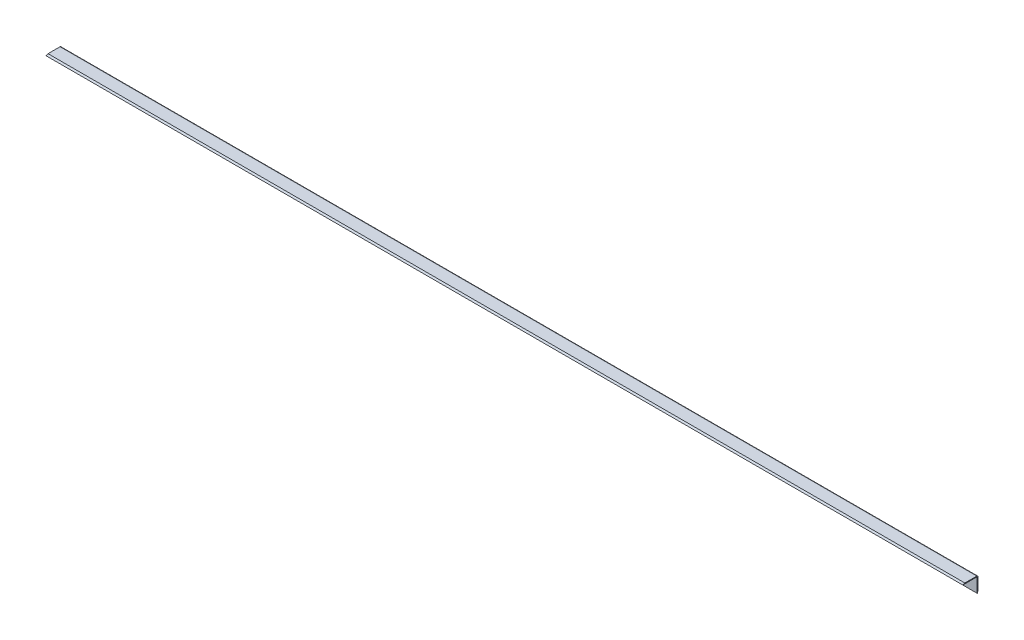
ISO-10303-21;
HEADER;
FILE_DESCRIPTION(('STEP AP214'),'2;1');
FILE_NAME('part.step','',(''),(''),'','','');
FILE_SCHEMA(('AUTOMOTIVE_DESIGN { 1 0 10303 214 1 1 1 1 }'));
ENDSEC;
DATA;
#1=APPLICATION_CONTEXT('core data for automotive mechanical design processes');
#2=APPLICATION_PROTOCOL_DEFINITION('international standard','automotive_design',2000,#1);
#3=PRODUCT_CONTEXT('',#1,'mechanical');
#4=PRODUCT('Part','Part','',(#3));
#5=PRODUCT_RELATED_PRODUCT_CATEGORY('part','',(#4));
#6=PRODUCT_DEFINITION_FORMATION('','',#4);
#7=PRODUCT_DEFINITION_CONTEXT('part definition',#1,'design');
#8=PRODUCT_DEFINITION('design','',#6,#7);
#9=PRODUCT_DEFINITION_SHAPE('','',#8);
#10=(LENGTH_UNIT() NAMED_UNIT(*) SI_UNIT(.MILLI.,.METRE.));
#11=(NAMED_UNIT(*) PLANE_ANGLE_UNIT() SI_UNIT($,.RADIAN.));
#12=(NAMED_UNIT(*) SI_UNIT($,.STERADIAN.) SOLID_ANGLE_UNIT());
#13=UNCERTAINTY_MEASURE_WITH_UNIT(LENGTH_MEASURE(1.E-05),#10,'distance_accuracy_value','');
#14=(GEOMETRIC_REPRESENTATION_CONTEXT(3) GLOBAL_UNCERTAINTY_ASSIGNED_CONTEXT((#13)) GLOBAL_UNIT_ASSIGNED_CONTEXT((#10,
#11,#12)) REPRESENTATION_CONTEXT('',''));
#15=CARTESIAN_POINT('',(0.,0.,0.));
#16=DIRECTION('',(0.,0.,1.));
#17=DIRECTION('',(1.,0.,0.));
#18=AXIS2_PLACEMENT_3D('',#15,#16,#17);
#19=CARTESIAN_POINT('',(904.875,-1.5,0.));
#20=DIRECTION('',(0.,1.,0.));
#21=DIRECTION('',(0.,0.,1.));
#22=AXIS2_PLACEMENT_3D('',#19,#20,#21);
#23=PLANE('',#22);
#24=DIRECTION('',(0.,0.,-1.));
#25=VECTOR('',#24,1.);
#26=CARTESIAN_POINT('',(-904.875,-1.5,0.));
#27=LINE('',#26,#25);
#28=CARTESIAN_POINT('',(-904.875,-1.5,0.));
#29=VERTEX_POINT('',#28);
#30=CARTESIAN_POINT('',(-904.875,-1.5,-28.5));
#31=VERTEX_POINT('',#30);
#32=EDGE_CURVE('E153',#29,#31,#27,.T.);
#33=ORIENTED_EDGE('',*,*,#32,.T.);
#34=DIRECTION('',(-1.,0.,0.));
#35=VECTOR('',#34,1.);
#36=CARTESIAN_POINT('',(904.875,-1.5,-28.5));
#37=LINE('',#36,#35);
#38=CARTESIAN_POINT('',(904.875,-1.5,-28.5));
#39=VERTEX_POINT('',#38);
#40=EDGE_CURVE('E117',#39,#31,#37,.T.);
#41=ORIENTED_EDGE('',*,*,#40,.F.);
#42=DIRECTION('',(0.,0.,-1.));
#43=VECTOR('',#42,1.);
#44=CARTESIAN_POINT('',(904.875,-1.5,0.));
#45=LINE('',#44,#43);
#46=CARTESIAN_POINT('',(904.875,-1.5,0.));
#47=VERTEX_POINT('',#46);
#48=EDGE_CURVE('E103',#47,#39,#45,.T.);
#49=ORIENTED_EDGE('',*,*,#48,.F.);
#50=DIRECTION('',(-1.,0.,0.));
#51=VECTOR('',#50,1.);
#52=CARTESIAN_POINT('',(904.875,-1.5,0.));
#53=LINE('',#52,#51);
#54=EDGE_CURVE('E115',#47,#29,#53,.T.);
#55=ORIENTED_EDGE('',*,*,#54,.T.);
#56=EDGE_LOOP('',(#33,#41,#49,#55));
#57=FACE_BOUND('',#56,.T.);
#58=ADVANCED_FACE('F43',(#57),#23,.F.);
#59=CARTESIAN_POINT('',(904.875,-1.5,-28.5));
#60=DIRECTION('',(0.,0.,-1.));
#61=DIRECTION('',(-1.,0.,0.));
#62=AXIS2_PLACEMENT_3D('',#59,#60,#61);
#63=PLANE('',#62);
#64=DIRECTION('',(0.,-1.,0.));
#65=VECTOR('',#64,1.);
#66=CARTESIAN_POINT('',(-904.875,-1.5,-28.5));
#67=LINE('',#66,#65);
#68=CARTESIAN_POINT('',(-904.875,-30.,-28.5));
#69=VERTEX_POINT('',#68);
#70=EDGE_CURVE('E148',#31,#69,#67,.T.);
#71=ORIENTED_EDGE('',*,*,#70,.T.);
#72=DIRECTION('',(-1.,0.,0.));
#73=VECTOR('',#72,1.);
#74=CARTESIAN_POINT('',(904.875,-30.,-28.5));
#75=LINE('',#74,#73);
#76=CARTESIAN_POINT('',(904.875,-30.,-28.5));
#77=VERTEX_POINT('',#76);
#78=EDGE_CURVE('E130',#77,#69,#75,.T.);
#79=ORIENTED_EDGE('',*,*,#78,.F.);
#80=DIRECTION('',(0.,-1.,0.));
#81=VECTOR('',#80,1.);
#82=CARTESIAN_POINT('',(904.875,-1.5,-28.5));
#83=LINE('',#82,#81);
#84=EDGE_CURVE('E119',#39,#77,#83,.T.);
#85=ORIENTED_EDGE('',*,*,#84,.F.);
#86=ORIENTED_EDGE('',*,*,#40,.T.);
#87=EDGE_LOOP('',(#71,#79,#85,#86));
#88=FACE_BOUND('',#87,.T.);
#89=ADVANCED_FACE('F152',(#88),#63,.F.);
#90=CARTESIAN_POINT('',(904.875,0.,-30.));
#91=DIRECTION('',(0.,0.,1.));
#92=DIRECTION('',(0.,-1.,0.));
#93=AXIS2_PLACEMENT_3D('',#90,#91,#92);
#94=PLANE('',#93);
#95=DIRECTION('',(0.,1.,0.));
#96=VECTOR('',#95,1.);
#97=CARTESIAN_POINT('',(904.875,0.,-30.));
#98=LINE('',#97,#96);
#99=CARTESIAN_POINT('',(904.875,-25.9999999999998,-30.));
#100=VERTEX_POINT('',#99);
#101=CARTESIAN_POINT('',(904.875,-2.5,-30.));
#102=VERTEX_POINT('',#101);
#103=EDGE_CURVE('E155',#100,#102,#98,.T.);
#104=ORIENTED_EDGE('',*,*,#103,.F.);
#105=DIRECTION('',(-1.,0.,0.));
#106=VECTOR('',#105,1.);
#107=CARTESIAN_POINT('',(904.875,-25.9999999999998,-30.));
#108=LINE('',#107,#106);
#109=CARTESIAN_POINT('',(-904.875,-25.9999999999998,-30.));
#110=VERTEX_POINT('',#109);
#111=EDGE_CURVE('E110',#100,#110,#108,.T.);
#112=ORIENTED_EDGE('',*,*,#111,.T.);
#113=DIRECTION('',(0.,1.,0.));
#114=VECTOR('',#113,1.);
#115=CARTESIAN_POINT('',(-904.875,0.,-30.));
#116=LINE('',#115,#114);
#117=CARTESIAN_POINT('',(-904.875,-2.5,-30.));
#118=VERTEX_POINT('',#117);
#119=EDGE_CURVE('E149',#110,#118,#116,.T.);
#120=ORIENTED_EDGE('',*,*,#119,.T.);
#121=DIRECTION('',(-1.,0.,0.));
#122=VECTOR('',#121,1.);
#123=CARTESIAN_POINT('',(904.875,-2.5,-30.));
#124=LINE('',#123,#122);
#125=EDGE_CURVE('E136',#118,#102,#124,.F.);
#126=ORIENTED_EDGE('',*,*,#125,.T.);
#127=EDGE_LOOP('',(#104,#112,#120,#126));
#128=FACE_BOUND('',#127,.T.);
#129=ADVANCED_FACE('F166',(#128),#94,.F.);
#130=CARTESIAN_POINT('',(904.875,0.,0.));
#131=DIRECTION('',(0.,-1.,0.));
#132=DIRECTION('',(0.,0.,-1.));
#133=AXIS2_PLACEMENT_3D('',#130,#131,#132);
#134=PLANE('',#133);
#135=DIRECTION('',(0.,0.,1.));
#136=VECTOR('',#135,1.);
#137=CARTESIAN_POINT('',(-904.875,0.,0.));
#138=LINE('',#137,#136);
#139=CARTESIAN_POINT('',(-904.875,0.,-27.5));
#140=VERTEX_POINT('',#139);
#141=CARTESIAN_POINT('',(-904.875,0.,-4.));
#142=VERTEX_POINT('',#141);
#143=EDGE_CURVE('E120',#140,#142,#138,.T.);
#144=ORIENTED_EDGE('',*,*,#143,.T.);
#145=DIRECTION('',(1.,0.,0.));
#146=VECTOR('',#145,1.);
#147=CARTESIAN_POINT('',(904.875,0.,-4.));
#148=LINE('',#147,#146);
#149=CARTESIAN_POINT('',(904.875,0.,-4.));
#150=VERTEX_POINT('',#149);
#151=EDGE_CURVE('E111',#142,#150,#148,.T.);
#152=ORIENTED_EDGE('',*,*,#151,.T.);
#153=DIRECTION('',(0.,0.,1.));
#154=VECTOR('',#153,1.);
#155=CARTESIAN_POINT('',(904.875,0.,0.));
#156=LINE('',#155,#154);
#157=CARTESIAN_POINT('',(904.875,0.,-27.5));
#158=VERTEX_POINT('',#157);
#159=EDGE_CURVE('E106',#158,#150,#156,.T.);
#160=ORIENTED_EDGE('',*,*,#159,.F.);
#161=DIRECTION('',(-1.,0.,0.));
#162=VECTOR('',#161,1.);
#163=CARTESIAN_POINT('',(904.875,0.,-27.5));
#164=LINE('',#163,#162);
#165=EDGE_CURVE('E125',#158,#140,#164,.T.);
#166=ORIENTED_EDGE('',*,*,#165,.T.);
#167=EDGE_LOOP('',(#144,#152,#160,#166));
#168=FACE_BOUND('',#167,.T.);
#169=ADVANCED_FACE('F172',(#168),#134,.F.);
#170=CARTESIAN_POINT('',(904.875,0.,0.));
#171=DIRECTION('',(1.,0.,0.));
#172=DIRECTION('',(0.,0.,-1.));
#173=AXIS2_PLACEMENT_3D('',#170,#171,#172);
#174=PLANE('',#173);
#175=ORIENTED_EDGE('',*,*,#84,.T.);
#176=DIRECTION('',(0.,-0.936329177569047,0.351123441588386));
#177=VECTOR('',#176,1.);
#178=CARTESIAN_POINT('',(904.875,-13.0684931506847,-34.8493150684931));
#179=LINE('',#178,#177);
#180=EDGE_CURVE('E11',#77,#100,#179,.F.);
#181=ORIENTED_EDGE('',*,*,#180,.T.);
#182=ORIENTED_EDGE('',*,*,#103,.T.);
#183=CARTESIAN_POINT('',(904.875,-2.5,-27.5));
#184=DIRECTION('',(1.,0.,0.));
#185=DIRECTION('',(0.,0.,-1.));
#186=AXIS2_PLACEMENT_3D('',#183,#184,#185);
#187=CIRCLE('',#186,2.5);
#188=EDGE_CURVE('E139',#102,#158,#187,.T.);
#189=ORIENTED_EDGE('',*,*,#188,.T.);
#190=ORIENTED_EDGE('',*,*,#159,.T.);
#191=DIRECTION('',(0.,0.351123441588403,-0.93632917756904));
#192=VECTOR('',#191,1.);
#193=CARTESIAN_POINT('',(904.875,-1.31506849315072,-0.493150684931539));
#194=LINE('',#193,#192);
#195=EDGE_CURVE('E100',#150,#47,#194,.F.);
#196=ORIENTED_EDGE('',*,*,#195,.T.);
#197=ORIENTED_EDGE('',*,*,#48,.T.);
#198=EDGE_LOOP('',(#175,#181,#182,#189,#190,#196,#197));
#199=FACE_BOUND('',#198,.T.);
#200=ADVANCED_FACE('F102',(#199),#174,.T.);
#201=CARTESIAN_POINT('',(-904.875,0.,0.));
#202=DIRECTION('',(1.,0.,0.));
#203=DIRECTION('',(0.,0.,-1.));
#204=AXIS2_PLACEMENT_3D('',#201,#202,#203);
#205=PLANE('',#204);
#206=ORIENTED_EDGE('',*,*,#119,.F.);
#207=DIRECTION('',(0.,0.936329177569047,-0.351123441588386));
#208=VECTOR('',#207,1.);
#209=CARTESIAN_POINT('',(-904.875,-25.9999999999998,-30.));
#210=LINE('',#209,#208);
#211=EDGE_CURVE('E52',#110,#69,#210,.F.);
#212=ORIENTED_EDGE('',*,*,#211,.T.);
#213=ORIENTED_EDGE('',*,*,#70,.F.);
#214=ORIENTED_EDGE('',*,*,#32,.F.);
#215=DIRECTION('',(0.,-0.351123441588403,0.93632917756904));
#216=VECTOR('',#215,1.);
#217=CARTESIAN_POINT('',(-904.875,-1.50000000000006,0.));
#218=LINE('',#217,#216);
#219=EDGE_CURVE('E123',#29,#142,#218,.F.);
#220=ORIENTED_EDGE('',*,*,#219,.T.);
#221=ORIENTED_EDGE('',*,*,#143,.F.);
#222=CARTESIAN_POINT('',(-904.875,-2.5,-27.5));
#223=DIRECTION('',(1.,0.,0.));
#224=DIRECTION('',(0.,0.,-1.));
#225=AXIS2_PLACEMENT_3D('',#222,#223,#224);
#226=CIRCLE('',#225,2.5);
#227=EDGE_CURVE('E128',#140,#118,#226,.F.);
#228=ORIENTED_EDGE('',*,*,#227,.T.);
#229=EDGE_LOOP('',(#206,#212,#213,#214,#220,#221,#228));
#230=FACE_BOUND('',#229,.T.);
#231=ADVANCED_FACE('F147',(#230),#205,.F.);
#232=CARTESIAN_POINT('',(904.875,-2.5,-27.5));
#233=DIRECTION('',(-1.,0.,0.));
#234=DIRECTION('',(0.,0.,1.));
#235=AXIS2_PLACEMENT_3D('',#232,#233,#234);
#236=CYLINDRICAL_SURFACE('',#235,2.5);
#237=ORIENTED_EDGE('',*,*,#188,.F.);
#238=ORIENTED_EDGE('',*,*,#125,.F.);
#239=ORIENTED_EDGE('',*,*,#227,.F.);
#240=ORIENTED_EDGE('',*,*,#165,.F.);
#241=EDGE_LOOP('',(#237,#238,#239,#240));
#242=FACE_BOUND('',#241,.T.);
#243=ADVANCED_FACE('F169',(#242),#236,.T.);
#244=CARTESIAN_POINT('',(904.875,-1.50000000000006,0.));
#245=DIRECTION('',(0.,-0.93632917756904,-0.351123441588403));
#246=DIRECTION('',(-1.,0.,0.));
#247=AXIS2_PLACEMENT_3D('',#244,#245,#246);
#248=PLANE('',#247);
#249=ORIENTED_EDGE('',*,*,#195,.F.);
#250=ORIENTED_EDGE('',*,*,#151,.F.);
#251=ORIENTED_EDGE('',*,*,#219,.F.);
#252=ORIENTED_EDGE('',*,*,#54,.F.);
#253=EDGE_LOOP('',(#249,#250,#251,#252));
#254=FACE_BOUND('',#253,.T.);
#255=ADVANCED_FACE('F122',(#254),#248,.F.);
#256=CARTESIAN_POINT('',(904.875,-25.9999999999998,-30.));
#257=DIRECTION('',(0.,0.351123441588386,0.936329177569047));
#258=DIRECTION('',(-1.,0.,0.));
#259=AXIS2_PLACEMENT_3D('',#256,#257,#258);
#260=PLANE('',#259);
#261=ORIENTED_EDGE('',*,*,#180,.F.);
#262=ORIENTED_EDGE('',*,*,#78,.T.);
#263=ORIENTED_EDGE('',*,*,#211,.F.);
#264=ORIENTED_EDGE('',*,*,#111,.F.);
#265=EDGE_LOOP('',(#261,#262,#263,#264));
#266=FACE_BOUND('',#265,.T.);
#267=ADVANCED_FACE('F46',(#266),#260,.F.);
#268=CLOSED_SHELL('',(#58,#89,#129,#169,#200,#231,#243,#255,#267));
#269=MANIFOLD_SOLID_BREP('B2',#268);
#270=ADVANCED_BREP_SHAPE_REPRESENTATION('',(#18,#269),#14);
#271=SHAPE_DEFINITION_REPRESENTATION(#9,#270);
ENDSEC;
END-ISO-10303-21;
